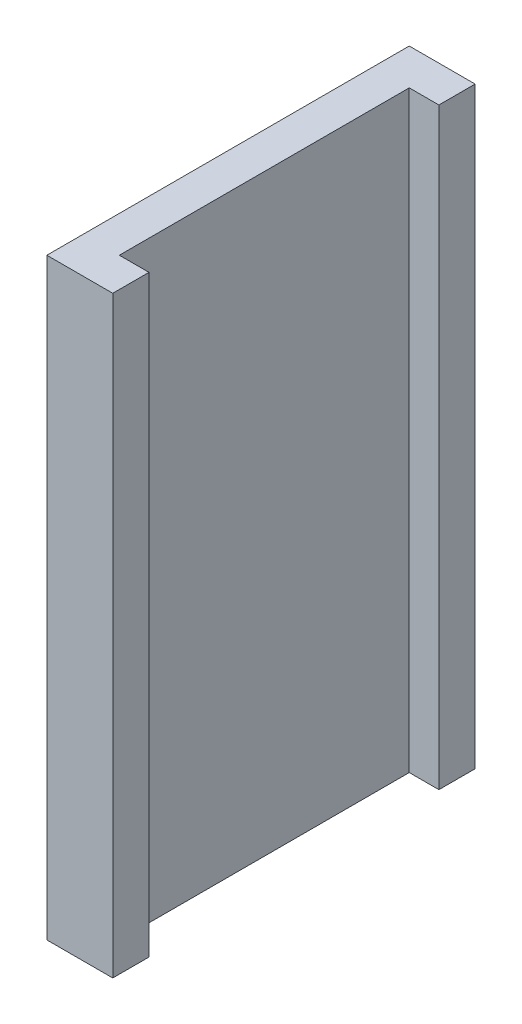
ISO-10303-21;
HEADER;
FILE_DESCRIPTION(('STEP AP214'),'2;1');
FILE_NAME('part.step','',(''),(''),'','','');
FILE_SCHEMA(('AUTOMOTIVE_DESIGN { 1 0 10303 214 1 1 1 1 }'));
ENDSEC;
DATA;
#1=APPLICATION_CONTEXT('core data for automotive mechanical design processes');
#2=APPLICATION_PROTOCOL_DEFINITION('international standard','automotive_design',2000,#1);
#3=PRODUCT_CONTEXT('',#1,'mechanical');
#4=PRODUCT('Part','Part','',(#3));
#5=PRODUCT_RELATED_PRODUCT_CATEGORY('part','',(#4));
#6=PRODUCT_DEFINITION_FORMATION('','',#4);
#7=PRODUCT_DEFINITION_CONTEXT('part definition',#1,'design');
#8=PRODUCT_DEFINITION('design','',#6,#7);
#9=PRODUCT_DEFINITION_SHAPE('','',#8);
#10=(LENGTH_UNIT() NAMED_UNIT(*) SI_UNIT(.MILLI.,.METRE.));
#11=(NAMED_UNIT(*) PLANE_ANGLE_UNIT() SI_UNIT($,.RADIAN.));
#12=(NAMED_UNIT(*) SI_UNIT($,.STERADIAN.) SOLID_ANGLE_UNIT());
#13=UNCERTAINTY_MEASURE_WITH_UNIT(LENGTH_MEASURE(1.E-05),#10,'distance_accuracy_value','');
#14=(GEOMETRIC_REPRESENTATION_CONTEXT(3) GLOBAL_UNCERTAINTY_ASSIGNED_CONTEXT((#13)) GLOBAL_UNIT_ASSIGNED_CONTEXT((#10,
#11,#12)) REPRESENTATION_CONTEXT('',''));
#15=CARTESIAN_POINT('',(0.,0.,0.));
#16=DIRECTION('',(0.,0.,1.));
#17=DIRECTION('',(1.,0.,0.));
#18=AXIS2_PLACEMENT_3D('',#15,#16,#17);
#19=CARTESIAN_POINT('',(0.1,0.,0.));
#20=DIRECTION('',(1.,0.,0.));
#21=DIRECTION('',(0.,0.,-1.));
#22=AXIS2_PLACEMENT_3D('',#19,#20,#21);
#23=PLANE('',#22);
#24=DIRECTION('',(0.,0.,1.));
#25=VECTOR('',#24,1.);
#26=CARTESIAN_POINT('',(0.1,0.9,0.));
#27=LINE('',#26,#25);
#28=CARTESIAN_POINT('',(0.1,0.9,0.055));
#29=VERTEX_POINT('',#28);
#30=CARTESIAN_POINT('',(0.1,0.9,0.));
#31=VERTEX_POINT('',#30);
#32=EDGE_CURVE('E100',#29,#31,#27,.F.);
#33=ORIENTED_EDGE('',*,*,#32,.F.);
#34=DIRECTION('',(0.,1.,0.));
#35=VECTOR('',#34,1.);
#36=CARTESIAN_POINT('',(0.1,0.,0.055));
#37=LINE('',#36,#35);
#38=CARTESIAN_POINT('',(0.1,0.,0.055));
#39=VERTEX_POINT('',#38);
#40=EDGE_CURVE('E99',#39,#29,#37,.T.);
#41=ORIENTED_EDGE('',*,*,#40,.F.);
#42=DIRECTION('',(0.,0.,1.));
#43=VECTOR('',#42,1.);
#44=CARTESIAN_POINT('',(0.1,0.,0.));
#45=LINE('',#44,#43);
#46=CARTESIAN_POINT('',(0.1,0.,0.));
#47=VERTEX_POINT('',#46);
#48=EDGE_CURVE('E84',#39,#47,#45,.F.);
#49=ORIENTED_EDGE('',*,*,#48,.T.);
#50=DIRECTION('',(0.,1.,0.));
#51=VECTOR('',#50,1.);
#52=CARTESIAN_POINT('',(0.1,0.,0.));
#53=LINE('',#52,#51);
#54=EDGE_CURVE('E110',#47,#31,#53,.T.);
#55=ORIENTED_EDGE('',*,*,#54,.T.);
#56=EDGE_LOOP('',(#33,#41,#49,#55));
#57=FACE_BOUND('',#56,.T.);
#58=ADVANCED_FACE('F17',(#57),#23,.T.);
#59=CARTESIAN_POINT('',(0.055,0.,0.495));
#60=DIRECTION('',(0.,0.,1.));
#61=DIRECTION('',(1.,0.,0.));
#62=AXIS2_PLACEMENT_3D('',#59,#60,#61);
#63=PLANE('',#62);
#64=DIRECTION('',(1.,0.,0.));
#65=VECTOR('',#64,1.);
#66=CARTESIAN_POINT('',(0.,0.,0.495));
#67=LINE('',#66,#65);
#68=CARTESIAN_POINT('',(0.1,0.,0.495));
#69=VERTEX_POINT('',#68);
#70=CARTESIAN_POINT('',(0.055,0.,0.495));
#71=VERTEX_POINT('',#70);
#72=EDGE_CURVE('E112',#69,#71,#67,.F.);
#73=ORIENTED_EDGE('',*,*,#72,.T.);
#74=DIRECTION('',(0.,1.,0.));
#75=VECTOR('',#74,1.);
#76=CARTESIAN_POINT('',(0.055,0.,0.495));
#77=LINE('',#76,#75);
#78=CARTESIAN_POINT('',(0.055,0.9,0.495));
#79=VERTEX_POINT('',#78);
#80=EDGE_CURVE('E20',#79,#71,#77,.F.);
#81=ORIENTED_EDGE('',*,*,#80,.F.);
#82=DIRECTION('',(1.,0.,0.));
#83=VECTOR('',#82,1.);
#84=CARTESIAN_POINT('',(0.,0.9,0.495));
#85=LINE('',#84,#83);
#86=CARTESIAN_POINT('',(0.1,0.9,0.495));
#87=VERTEX_POINT('',#86);
#88=EDGE_CURVE('E226',#87,#79,#85,.F.);
#89=ORIENTED_EDGE('',*,*,#88,.F.);
#90=DIRECTION('',(0.,1.,0.));
#91=VECTOR('',#90,1.);
#92=CARTESIAN_POINT('',(0.1,0.,0.495));
#93=LINE('',#92,#91);
#94=EDGE_CURVE('E78',#69,#87,#93,.T.);
#95=ORIENTED_EDGE('',*,*,#94,.F.);
#96=EDGE_LOOP('',(#73,#81,#89,#95));
#97=FACE_BOUND('',#96,.T.);
#98=ADVANCED_FACE('F124',(#97),#63,.F.);
#99=CARTESIAN_POINT('',(0.055,0.,0.055));
#100=DIRECTION('',(1.,0.,0.));
#101=DIRECTION('',(0.,0.,-1.));
#102=AXIS2_PLACEMENT_3D('',#99,#100,#101);
#103=PLANE('',#102);
#104=DIRECTION('',(0.,0.,1.));
#105=VECTOR('',#104,1.);
#106=CARTESIAN_POINT('',(0.055,0.9,0.));
#107=LINE('',#106,#105);
#108=CARTESIAN_POINT('',(0.055,0.9,0.055));
#109=VERTEX_POINT('',#108);
#110=EDGE_CURVE('E123',#79,#109,#107,.F.);
#111=ORIENTED_EDGE('',*,*,#110,.F.);
#112=ORIENTED_EDGE('',*,*,#80,.T.);
#113=DIRECTION('',(0.,0.,1.));
#114=VECTOR('',#113,1.);
#115=CARTESIAN_POINT('',(0.055,0.,0.));
#116=LINE('',#115,#114);
#117=CARTESIAN_POINT('',(0.055,0.,0.055));
#118=VERTEX_POINT('',#117);
#119=EDGE_CURVE('E108',#71,#118,#116,.F.);
#120=ORIENTED_EDGE('',*,*,#119,.T.);
#121=DIRECTION('',(0.,1.,0.));
#122=VECTOR('',#121,1.);
#123=CARTESIAN_POINT('',(0.055,0.,0.055));
#124=LINE('',#123,#122);
#125=EDGE_CURVE('E104',#109,#118,#124,.F.);
#126=ORIENTED_EDGE('',*,*,#125,.F.);
#127=EDGE_LOOP('',(#111,#112,#120,#126));
#128=FACE_BOUND('',#127,.T.);
#129=ADVANCED_FACE('F122',(#128),#103,.T.);
#130=CARTESIAN_POINT('',(0.055,0.,0.055));
#131=DIRECTION('',(0.,0.,1.));
#132=DIRECTION('',(1.,0.,0.));
#133=AXIS2_PLACEMENT_3D('',#130,#131,#132);
#134=PLANE('',#133);
#135=DIRECTION('',(1.,0.,0.));
#136=VECTOR('',#135,1.);
#137=CARTESIAN_POINT('',(0.,0.,0.055));
#138=LINE('',#137,#136);
#139=EDGE_CURVE('E89',#118,#39,#138,.T.);
#140=ORIENTED_EDGE('',*,*,#139,.T.);
#141=ORIENTED_EDGE('',*,*,#40,.T.);
#142=DIRECTION('',(1.,0.,0.));
#143=VECTOR('',#142,1.);
#144=CARTESIAN_POINT('',(0.,0.9,0.055));
#145=LINE('',#144,#143);
#146=EDGE_CURVE('E240',#109,#29,#145,.T.);
#147=ORIENTED_EDGE('',*,*,#146,.F.);
#148=ORIENTED_EDGE('',*,*,#125,.T.);
#149=EDGE_LOOP('',(#140,#141,#147,#148));
#150=FACE_BOUND('',#149,.T.);
#151=ADVANCED_FACE('F106',(#150),#134,.T.);
#152=CARTESIAN_POINT('',(0.1,0.,0.));
#153=DIRECTION('',(1.,0.,0.));
#154=DIRECTION('',(0.,0.,-1.));
#155=AXIS2_PLACEMENT_3D('',#152,#153,#154);
#156=PLANE('',#155);
#157=DIRECTION('',(0.,0.,1.));
#158=VECTOR('',#157,1.);
#159=CARTESIAN_POINT('',(0.1,0.9,0.));
#160=LINE('',#159,#158);
#161=CARTESIAN_POINT('',(0.1,0.9,0.55));
#162=VERTEX_POINT('',#161);
#163=EDGE_CURVE('E224',#162,#87,#160,.F.);
#164=ORIENTED_EDGE('',*,*,#163,.F.);
#165=DIRECTION('',(0.,1.,0.));
#166=VECTOR('',#165,1.);
#167=CARTESIAN_POINT('',(0.1,0.,0.55));
#168=LINE('',#167,#166);
#169=CARTESIAN_POINT('',(0.1,0.,0.55));
#170=VERTEX_POINT('',#169);
#171=EDGE_CURVE('E225',#170,#162,#168,.T.);
#172=ORIENTED_EDGE('',*,*,#171,.F.);
#173=DIRECTION('',(0.,0.,1.));
#174=VECTOR('',#173,1.);
#175=CARTESIAN_POINT('',(0.1,0.,0.));
#176=LINE('',#175,#174);
#177=EDGE_CURVE('E96',#170,#69,#176,.F.);
#178=ORIENTED_EDGE('',*,*,#177,.T.);
#179=ORIENTED_EDGE('',*,*,#94,.T.);
#180=EDGE_LOOP('',(#164,#172,#178,#179));
#181=FACE_BOUND('',#180,.T.);
#182=ADVANCED_FACE('F153',(#181),#156,.T.);
#183=CARTESIAN_POINT('',(0.,0.,0.));
#184=DIRECTION('',(0.,1.,0.));
#185=DIRECTION('',(0.,0.,1.));
#186=AXIS2_PLACEMENT_3D('',#183,#184,#185);
#187=PLANE('',#186);
#188=ORIENTED_EDGE('',*,*,#119,.F.);
#189=ORIENTED_EDGE('',*,*,#72,.F.);
#190=ORIENTED_EDGE('',*,*,#177,.F.);
#191=DIRECTION('',(1.,0.,0.));
#192=VECTOR('',#191,1.);
#193=CARTESIAN_POINT('',(0.,0.,0.55));
#194=LINE('',#193,#192);
#195=CARTESIAN_POINT('',(0.,0.,0.55));
#196=VERTEX_POINT('',#195);
#197=EDGE_CURVE('E234',#196,#170,#194,.T.);
#198=ORIENTED_EDGE('',*,*,#197,.F.);
#199=DIRECTION('',(0.,0.,-1.));
#200=VECTOR('',#199,1.);
#201=CARTESIAN_POINT('',(0.,0.,0.));
#202=LINE('',#201,#200);
#203=CARTESIAN_POINT('',(0.,0.,0.));
#204=VERTEX_POINT('',#203);
#205=EDGE_CURVE('E230',#196,#204,#202,.T.);
#206=ORIENTED_EDGE('',*,*,#205,.T.);
#207=DIRECTION('',(1.,0.,0.));
#208=VECTOR('',#207,1.);
#209=CARTESIAN_POINT('',(0.,0.,0.));
#210=LINE('',#209,#208);
#211=EDGE_CURVE('E92',#204,#47,#210,.T.);
#212=ORIENTED_EDGE('',*,*,#211,.T.);
#213=ORIENTED_EDGE('',*,*,#48,.F.);
#214=ORIENTED_EDGE('',*,*,#139,.F.);
#215=EDGE_LOOP('',(#188,#189,#190,#198,#206,#212,#213,#214));
#216=FACE_BOUND('',#215,.T.);
#217=ADVANCED_FACE('F87',(#216),#187,.F.);
#218=CARTESIAN_POINT('',(0.,0.,0.));
#219=DIRECTION('',(0.,0.,1.));
#220=DIRECTION('',(1.,0.,0.));
#221=AXIS2_PLACEMENT_3D('',#218,#219,#220);
#222=PLANE('',#221);
#223=ORIENTED_EDGE('',*,*,#54,.F.);
#224=ORIENTED_EDGE('',*,*,#211,.F.);
#225=DIRECTION('',(0.,1.,0.));
#226=VECTOR('',#225,1.);
#227=CARTESIAN_POINT('',(0.,0.,0.));
#228=LINE('',#227,#226);
#229=CARTESIAN_POINT('',(0.,0.9,0.));
#230=VERTEX_POINT('',#229);
#231=EDGE_CURVE('E232',#204,#230,#228,.T.);
#232=ORIENTED_EDGE('',*,*,#231,.T.);
#233=DIRECTION('',(1.,0.,0.));
#234=VECTOR('',#233,1.);
#235=CARTESIAN_POINT('',(0.,0.9,0.));
#236=LINE('',#235,#234);
#237=EDGE_CURVE('E227',#31,#230,#236,.F.);
#238=ORIENTED_EDGE('',*,*,#237,.F.);
#239=EDGE_LOOP('',(#223,#224,#232,#238));
#240=FACE_BOUND('',#239,.T.);
#241=ADVANCED_FACE('F146',(#240),#222,.F.);
#242=CARTESIAN_POINT('',(0.,0.9,0.));
#243=DIRECTION('',(0.,1.,0.));
#244=DIRECTION('',(0.,0.,1.));
#245=AXIS2_PLACEMENT_3D('',#242,#243,#244);
#246=PLANE('',#245);
#247=ORIENTED_EDGE('',*,*,#110,.T.);
#248=ORIENTED_EDGE('',*,*,#146,.T.);
#249=ORIENTED_EDGE('',*,*,#32,.T.);
#250=ORIENTED_EDGE('',*,*,#237,.T.);
#251=DIRECTION('',(0.,0.,-1.));
#252=VECTOR('',#251,1.);
#253=CARTESIAN_POINT('',(0.,0.9,0.));
#254=LINE('',#253,#252);
#255=CARTESIAN_POINT('',(0.,0.9,0.55));
#256=VERTEX_POINT('',#255);
#257=EDGE_CURVE('E26',#230,#256,#254,.F.);
#258=ORIENTED_EDGE('',*,*,#257,.T.);
#259=DIRECTION('',(1.,0.,0.));
#260=VECTOR('',#259,1.);
#261=CARTESIAN_POINT('',(0.,0.9,0.55));
#262=LINE('',#261,#260);
#263=EDGE_CURVE('E34',#162,#256,#262,.F.);
#264=ORIENTED_EDGE('',*,*,#263,.F.);
#265=ORIENTED_EDGE('',*,*,#163,.T.);
#266=ORIENTED_EDGE('',*,*,#88,.T.);
#267=EDGE_LOOP('',(#247,#248,#249,#250,#258,#264,#265,#266));
#268=FACE_BOUND('',#267,.T.);
#269=ADVANCED_FACE('F140',(#268),#246,.T.);
#270=CARTESIAN_POINT('',(0.,0.,0.55));
#271=DIRECTION('',(0.,0.,1.));
#272=DIRECTION('',(1.,0.,0.));
#273=AXIS2_PLACEMENT_3D('',#270,#271,#272);
#274=PLANE('',#273);
#275=ORIENTED_EDGE('',*,*,#171,.T.);
#276=ORIENTED_EDGE('',*,*,#263,.T.);
#277=DIRECTION('',(0.,1.,0.));
#278=VECTOR('',#277,1.);
#279=CARTESIAN_POINT('',(0.,0.,0.55));
#280=LINE('',#279,#278);
#281=EDGE_CURVE('E11',#256,#196,#280,.F.);
#282=ORIENTED_EDGE('',*,*,#281,.T.);
#283=ORIENTED_EDGE('',*,*,#197,.T.);
#284=EDGE_LOOP('',(#275,#276,#282,#283));
#285=FACE_BOUND('',#284,.T.);
#286=ADVANCED_FACE('F134',(#285),#274,.T.);
#287=CARTESIAN_POINT('',(0.,0.,0.));
#288=DIRECTION('',(1.,0.,0.));
#289=DIRECTION('',(0.,0.,-1.));
#290=AXIS2_PLACEMENT_3D('',#287,#288,#289);
#291=PLANE('',#290);
#292=ORIENTED_EDGE('',*,*,#257,.F.);
#293=ORIENTED_EDGE('',*,*,#231,.F.);
#294=ORIENTED_EDGE('',*,*,#205,.F.);
#295=ORIENTED_EDGE('',*,*,#281,.F.);
#296=EDGE_LOOP('',(#292,#293,#294,#295));
#297=FACE_BOUND('',#296,.T.);
#298=ADVANCED_FACE('F132',(#297),#291,.F.);
#299=CLOSED_SHELL('',(#58,#98,#129,#151,#182,#217,#241,#269,#286,#298));
#300=MANIFOLD_SOLID_BREP('B1',#299);
#301=ADVANCED_BREP_SHAPE_REPRESENTATION('',(#18,#300),#14);
#302=SHAPE_DEFINITION_REPRESENTATION(#9,#301);
ENDSEC;
END-ISO-10303-21;
